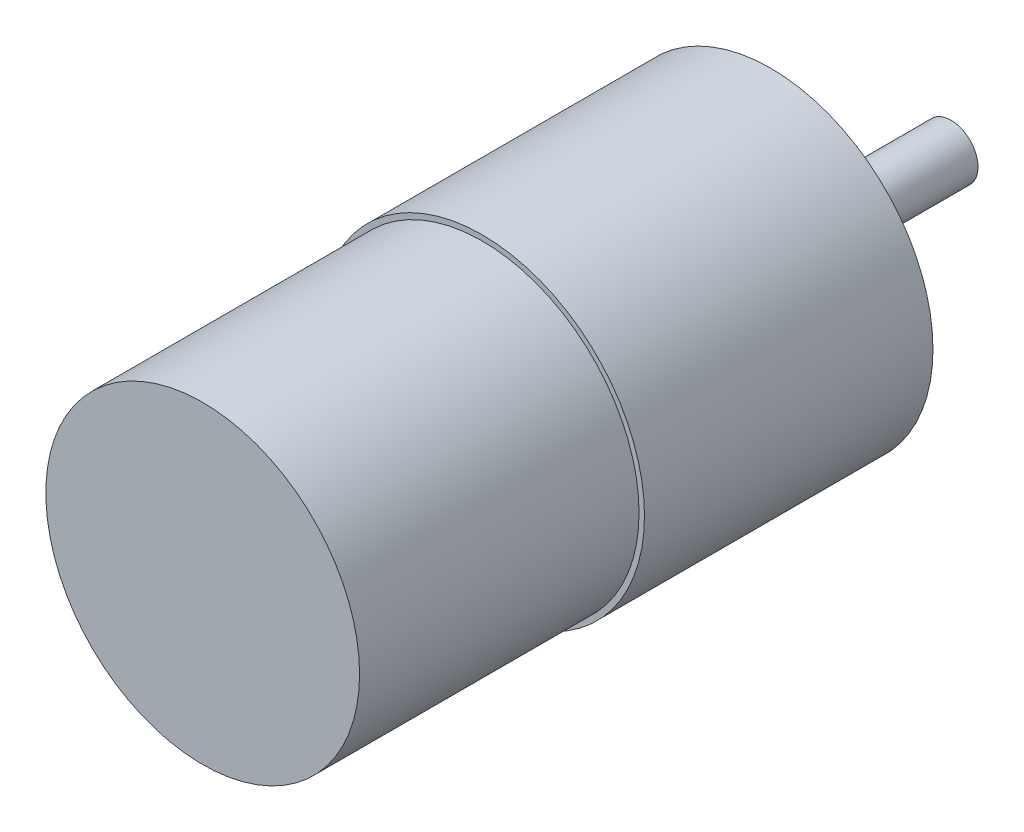
ISO-10303-21;
HEADER;
FILE_DESCRIPTION(('STEP AP214'),'2;1');
FILE_NAME('part.step','',(''),(''),'','','');
FILE_SCHEMA(('AUTOMOTIVE_DESIGN { 1 0 10303 214 1 1 1 1 }'));
ENDSEC;
DATA;
#1=APPLICATION_CONTEXT('core data for automotive mechanical design processes');
#2=APPLICATION_PROTOCOL_DEFINITION('international standard','automotive_design',2000,#1);
#3=PRODUCT_CONTEXT('',#1,'mechanical');
#4=PRODUCT('Part','Part','',(#3));
#5=PRODUCT_RELATED_PRODUCT_CATEGORY('part','',(#4));
#6=PRODUCT_DEFINITION_FORMATION('','',#4);
#7=PRODUCT_DEFINITION_CONTEXT('part definition',#1,'design');
#8=PRODUCT_DEFINITION('design','',#6,#7);
#9=PRODUCT_DEFINITION_SHAPE('','',#8);
#10=(LENGTH_UNIT() NAMED_UNIT(*) SI_UNIT(.MILLI.,.METRE.));
#11=(NAMED_UNIT(*) PLANE_ANGLE_UNIT() SI_UNIT($,.RADIAN.));
#12=(NAMED_UNIT(*) SI_UNIT($,.STERADIAN.) SOLID_ANGLE_UNIT());
#13=UNCERTAINTY_MEASURE_WITH_UNIT(LENGTH_MEASURE(1.E-05),#10,'distance_accuracy_value','');
#14=(GEOMETRIC_REPRESENTATION_CONTEXT(3) GLOBAL_UNCERTAINTY_ASSIGNED_CONTEXT((#13)) GLOBAL_UNIT_ASSIGNED_CONTEXT((#10,
#11,#12)) REPRESENTATION_CONTEXT('',''));
#15=CARTESIAN_POINT('',(0.,0.,0.));
#16=DIRECTION('',(0.,0.,1.));
#17=DIRECTION('',(1.,0.,0.));
#18=AXIS2_PLACEMENT_3D('',#15,#16,#17);
#19=CARTESIAN_POINT('',(0.,0.,32.));
#20=DIRECTION('',(0.,0.,-1.));
#21=DIRECTION('',(-1.,0.,0.));
#22=AXIS2_PLACEMENT_3D('',#19,#20,#21);
#23=CYLINDRICAL_SURFACE('',#22,18.);
#24=CARTESIAN_POINT('',(0.,0.,32.));
#25=DIRECTION('',(0.,0.,1.));
#26=DIRECTION('',(1.,0.,0.));
#27=AXIS2_PLACEMENT_3D('',#24,#25,#26);
#28=CIRCLE('',#27,18.);
#29=CARTESIAN_POINT('',(18.,0.,32.));
#30=VERTEX_POINT('',#29);
#31=EDGE_CURVE('E66',#30,#30,#28,.T.);
#32=ORIENTED_EDGE('',*,*,#31,.F.);
#33=EDGE_LOOP('',(#32));
#34=FACE_BOUND('',#33,.T.);
#35=CARTESIAN_POINT('',(0.,0.,0.));
#36=DIRECTION('',(0.,0.,1.));
#37=DIRECTION('',(1.,0.,0.));
#38=AXIS2_PLACEMENT_3D('',#35,#36,#37);
#39=CIRCLE('',#38,18.);
#40=CARTESIAN_POINT('',(18.,0.,0.));
#41=VERTEX_POINT('',#40);
#42=EDGE_CURVE('E38',#41,#41,#39,.T.);
#43=ORIENTED_EDGE('',*,*,#42,.T.);
#44=EDGE_LOOP('',(#43));
#45=FACE_BOUND('',#44,.T.);
#46=ADVANCED_FACE('F35',(#34,#45),#23,.T.);
#47=CARTESIAN_POINT('',(0.,0.,32.));
#48=DIRECTION('',(0.,0.,1.));
#49=DIRECTION('',(1.,0.,0.));
#50=AXIS2_PLACEMENT_3D('',#47,#48,#49);
#51=PLANE('',#50);
#52=CARTESIAN_POINT('',(0.,0.,32.));
#53=DIRECTION('',(0.,0.,1.));
#54=DIRECTION('',(1.,0.,0.));
#55=AXIS2_PLACEMENT_3D('',#52,#53,#54);
#56=CIRCLE('',#55,17.4);
#57=CARTESIAN_POINT('',(17.4,0.,32.));
#58=VERTEX_POINT('',#57);
#59=EDGE_CURVE('E62',#58,#58,#56,.T.);
#60=ORIENTED_EDGE('',*,*,#59,.F.);
#61=EDGE_LOOP('',(#60));
#62=FACE_BOUND('',#61,.T.);
#63=ORIENTED_EDGE('',*,*,#31,.T.);
#64=EDGE_LOOP('',(#63));
#65=FACE_BOUND('',#64,.T.);
#66=ADVANCED_FACE('F77',(#62,#65),#51,.T.);
#67=CARTESIAN_POINT('',(0.,0.,0.));
#68=DIRECTION('',(0.,0.,1.));
#69=DIRECTION('',(1.,0.,0.));
#70=AXIS2_PLACEMENT_3D('',#67,#68,#69);
#71=PLANE('',#70);
#72=CARTESIAN_POINT('',(14.,0.,0.));
#73=DIRECTION('',(0.,0.,-1.));
#74=DIRECTION('',(-1.,0.,0.));
#75=AXIS2_PLACEMENT_3D('',#72,#73,#74);
#76=CIRCLE('',#75,1.5);
#77=CARTESIAN_POINT('',(12.5,0.,0.));
#78=VERTEX_POINT('',#77);
#79=EDGE_CURVE('E266',#78,#78,#76,.T.);
#80=ORIENTED_EDGE('',*,*,#79,.F.);
#81=EDGE_LOOP('',(#80));
#82=FACE_BOUND('',#81,.T.);
#83=CARTESIAN_POINT('',(0.,14.,0.));
#84=DIRECTION('',(0.,0.,-1.));
#85=DIRECTION('',(-1.,0.,0.));
#86=AXIS2_PLACEMENT_3D('',#83,#84,#85);
#87=CIRCLE('',#86,1.5);
#88=CARTESIAN_POINT('',(-1.5,14.,0.));
#89=VERTEX_POINT('',#88);
#90=EDGE_CURVE('E270',#89,#89,#87,.T.);
#91=ORIENTED_EDGE('',*,*,#90,.F.);
#92=EDGE_LOOP('',(#91));
#93=FACE_BOUND('',#92,.T.);
#94=CARTESIAN_POINT('',(-14.,0.,0.));
#95=DIRECTION('',(0.,0.,-1.));
#96=DIRECTION('',(-1.,0.,0.));
#97=AXIS2_PLACEMENT_3D('',#94,#95,#96);
#98=CIRCLE('',#97,1.5);
#99=CARTESIAN_POINT('',(-15.5,0.,0.));
#100=VERTEX_POINT('',#99);
#101=EDGE_CURVE('E278',#100,#100,#98,.T.);
#102=ORIENTED_EDGE('',*,*,#101,.F.);
#103=EDGE_LOOP('',(#102));
#104=FACE_BOUND('',#103,.T.);
#105=CARTESIAN_POINT('',(0.,-14.,0.));
#106=DIRECTION('',(0.,0.,-1.));
#107=DIRECTION('',(-1.,0.,0.));
#108=AXIS2_PLACEMENT_3D('',#105,#106,#107);
#109=CIRCLE('',#108,1.5);
#110=CARTESIAN_POINT('',(-1.5,-14.,0.));
#111=VERTEX_POINT('',#110);
#112=EDGE_CURVE('E284',#111,#111,#109,.T.);
#113=ORIENTED_EDGE('',*,*,#112,.F.);
#114=EDGE_LOOP('',(#113));
#115=FACE_BOUND('',#114,.T.);
#116=CARTESIAN_POINT('',(0.,0.,0.));
#117=DIRECTION('',(0.,0.,-1.));
#118=DIRECTION('',(-1.,0.,0.));
#119=AXIS2_PLACEMENT_3D('',#116,#117,#118);
#120=CIRCLE('',#119,11.);
#121=CARTESIAN_POINT('',(-11.,0.,0.));
#122=VERTEX_POINT('',#121);
#123=EDGE_CURVE('E47',#122,#122,#120,.T.);
#124=ORIENTED_EDGE('',*,*,#123,.F.);
#125=EDGE_LOOP('',(#124));
#126=FACE_BOUND('',#125,.T.);
#127=ORIENTED_EDGE('',*,*,#42,.F.);
#128=EDGE_LOOP('',(#127));
#129=FACE_BOUND('',#128,.T.);
#130=ADVANCED_FACE('F74',(#82,#93,#104,#115,#126,#129),#71,.F.);
#131=CARTESIAN_POINT('',(0.,0.,63.));
#132=DIRECTION('',(0.,0.,-1.));
#133=DIRECTION('',(-1.,0.,0.));
#134=AXIS2_PLACEMENT_3D('',#131,#132,#133);
#135=CYLINDRICAL_SURFACE('',#134,17.4);
#136=CARTESIAN_POINT('',(0.,0.,63.));
#137=DIRECTION('',(0.,0.,1.));
#138=DIRECTION('',(1.,0.,0.));
#139=AXIS2_PLACEMENT_3D('',#136,#137,#138);
#140=CIRCLE('',#139,17.4);
#141=CARTESIAN_POINT('',(17.4,0.,63.));
#142=VERTEX_POINT('',#141);
#143=EDGE_CURVE('E59',#142,#142,#140,.T.);
#144=ORIENTED_EDGE('',*,*,#143,.F.);
#145=EDGE_LOOP('',(#144));
#146=FACE_BOUND('',#145,.T.);
#147=ORIENTED_EDGE('',*,*,#59,.T.);
#148=EDGE_LOOP('',(#147));
#149=FACE_BOUND('',#148,.T.);
#150=ADVANCED_FACE('F76',(#146,#149),#135,.T.);
#151=CARTESIAN_POINT('',(0.,0.,63.));
#152=DIRECTION('',(0.,0.,1.));
#153=DIRECTION('',(1.,0.,0.));
#154=AXIS2_PLACEMENT_3D('',#151,#152,#153);
#155=PLANE('',#154);
#156=ORIENTED_EDGE('',*,*,#143,.T.);
#157=EDGE_LOOP('',(#156));
#158=FACE_BOUND('',#157,.T.);
#159=ADVANCED_FACE('F83',(#158),#155,.T.);
#160=CARTESIAN_POINT('',(0.,0.,-2.));
#161=DIRECTION('',(0.,0.,1.));
#162=DIRECTION('',(1.,0.,0.));
#163=AXIS2_PLACEMENT_3D('',#160,#161,#162);
#164=CYLINDRICAL_SURFACE('',#163,11.);
#165=CARTESIAN_POINT('',(0.,0.,-2.));
#166=DIRECTION('',(0.,0.,-1.));
#167=DIRECTION('',(-1.,0.,0.));
#168=AXIS2_PLACEMENT_3D('',#165,#166,#167);
#169=CIRCLE('',#168,11.);
#170=CARTESIAN_POINT('',(-11.,0.,-2.));
#171=VERTEX_POINT('',#170);
#172=EDGE_CURVE('E55',#171,#171,#169,.T.);
#173=ORIENTED_EDGE('',*,*,#172,.F.);
#174=EDGE_LOOP('',(#173));
#175=FACE_BOUND('',#174,.T.);
#176=ORIENTED_EDGE('',*,*,#123,.T.);
#177=EDGE_LOOP('',(#176));
#178=FACE_BOUND('',#177,.T.);
#179=ADVANCED_FACE('F116',(#175,#178),#164,.T.);
#180=CARTESIAN_POINT('',(0.,0.,-2.));
#181=DIRECTION('',(0.,0.,-1.));
#182=DIRECTION('',(-1.,0.,0.));
#183=AXIS2_PLACEMENT_3D('',#180,#181,#182);
#184=PLANE('',#183);
#185=CARTESIAN_POINT('',(0.,0.,-2.));
#186=DIRECTION('',(0.,0.,-1.));
#187=DIRECTION('',(-1.,0.,0.));
#188=AXIS2_PLACEMENT_3D('',#185,#186,#187);
#189=CIRCLE('',#188,4.);
#190=CARTESIAN_POINT('',(-4.,0.,-2.));
#191=VERTEX_POINT('',#190);
#192=EDGE_CURVE('E42',#191,#191,#189,.T.);
#193=ORIENTED_EDGE('',*,*,#192,.F.);
#194=EDGE_LOOP('',(#193));
#195=FACE_BOUND('',#194,.T.);
#196=ORIENTED_EDGE('',*,*,#172,.T.);
#197=EDGE_LOOP('',(#196));
#198=FACE_BOUND('',#197,.T.);
#199=ADVANCED_FACE('F126',(#195,#198),#184,.T.);
#200=CARTESIAN_POINT('',(0.,0.,-5.));
#201=DIRECTION('',(0.,0.,1.));
#202=DIRECTION('',(1.,0.,0.));
#203=AXIS2_PLACEMENT_3D('',#200,#201,#202);
#204=CYLINDRICAL_SURFACE('',#203,4.);
#205=CARTESIAN_POINT('',(0.,0.,-5.));
#206=DIRECTION('',(0.,0.,-1.));
#207=DIRECTION('',(-1.,0.,0.));
#208=AXIS2_PLACEMENT_3D('',#205,#206,#207);
#209=CIRCLE('',#208,4.);
#210=CARTESIAN_POINT('',(-4.,0.,-5.));
#211=VERTEX_POINT('',#210);
#212=EDGE_CURVE('E53',#211,#211,#209,.T.);
#213=ORIENTED_EDGE('',*,*,#212,.F.);
#214=EDGE_LOOP('',(#213));
#215=FACE_BOUND('',#214,.T.);
#216=ORIENTED_EDGE('',*,*,#192,.T.);
#217=EDGE_LOOP('',(#216));
#218=FACE_BOUND('',#217,.T.);
#219=ADVANCED_FACE('F136',(#215,#218),#204,.T.);
#220=CARTESIAN_POINT('',(0.,0.,-5.));
#221=DIRECTION('',(0.,0.,-1.));
#222=DIRECTION('',(-1.,0.,0.));
#223=AXIS2_PLACEMENT_3D('',#220,#221,#222);
#224=PLANE('',#223);
#225=CARTESIAN_POINT('',(0.,0.,-5.));
#226=DIRECTION('',(0.,0.,-1.));
#227=DIRECTION('',(-1.,0.,0.));
#228=AXIS2_PLACEMENT_3D('',#225,#226,#227);
#229=CIRCLE('',#228,3.);
#230=CARTESIAN_POINT('',(-3.,0.,-5.));
#231=VERTEX_POINT('',#230);
#232=EDGE_CURVE('E10',#231,#231,#229,.T.);
#233=ORIENTED_EDGE('',*,*,#232,.F.);
#234=EDGE_LOOP('',(#233));
#235=FACE_BOUND('',#234,.T.);
#236=ORIENTED_EDGE('',*,*,#212,.T.);
#237=EDGE_LOOP('',(#236));
#238=FACE_BOUND('',#237,.T.);
#239=ADVANCED_FACE('F146',(#235,#238),#224,.T.);
#240=CARTESIAN_POINT('',(0.,0.,-20.));
#241=DIRECTION('',(0.,0.,1.));
#242=DIRECTION('',(1.,0.,0.));
#243=AXIS2_PLACEMENT_3D('',#240,#241,#242);
#244=CYLINDRICAL_SURFACE('',#243,3.);
#245=CARTESIAN_POINT('',(0.,0.,-20.));
#246=DIRECTION('',(0.,0.,-1.));
#247=DIRECTION('',(-1.,0.,0.));
#248=AXIS2_PLACEMENT_3D('',#245,#246,#247);
#249=CIRCLE('',#248,3.);
#250=CARTESIAN_POINT('',(-3.,0.,-20.));
#251=VERTEX_POINT('',#250);
#252=EDGE_CURVE('E51',#251,#251,#249,.T.);
#253=ORIENTED_EDGE('',*,*,#252,.F.);
#254=EDGE_LOOP('',(#253));
#255=FACE_BOUND('',#254,.T.);
#256=ORIENTED_EDGE('',*,*,#232,.T.);
#257=EDGE_LOOP('',(#256));
#258=FACE_BOUND('',#257,.T.);
#259=ADVANCED_FACE('F156',(#255,#258),#244,.T.);
#260=CARTESIAN_POINT('',(0.,0.,-20.));
#261=DIRECTION('',(0.,0.,-1.));
#262=DIRECTION('',(-1.,0.,0.));
#263=AXIS2_PLACEMENT_3D('',#260,#261,#262);
#264=PLANE('',#263);
#265=ORIENTED_EDGE('',*,*,#252,.T.);
#266=EDGE_LOOP('',(#265));
#267=FACE_BOUND('',#266,.T.);
#268=ADVANCED_FACE('F166',(#267),#264,.T.);
#269=CARTESIAN_POINT('',(0.,-14.,5.));
#270=DIRECTION('',(0.,0.,-1.));
#271=DIRECTION('',(-1.,0.,0.));
#272=AXIS2_PLACEMENT_3D('',#269,#270,#271);
#273=CYLINDRICAL_SURFACE('',#272,1.5);
#274=CARTESIAN_POINT('',(0.,-14.,5.));
#275=DIRECTION('',(0.,0.,-1.));
#276=DIRECTION('',(-1.,0.,0.));
#277=AXIS2_PLACEMENT_3D('',#274,#275,#276);
#278=CIRCLE('',#277,1.5);
#279=CARTESIAN_POINT('',(-1.5,-14.,5.));
#280=VERTEX_POINT('',#279);
#281=EDGE_CURVE('E286',#280,#280,#278,.T.);
#282=ORIENTED_EDGE('',*,*,#281,.F.);
#283=EDGE_LOOP('',(#282));
#284=FACE_BOUND('',#283,.T.);
#285=ORIENTED_EDGE('',*,*,#112,.T.);
#286=EDGE_LOOP('',(#285));
#287=FACE_BOUND('',#286,.T.);
#288=ADVANCED_FACE('F175',(#284,#287),#273,.F.);
#289=CARTESIAN_POINT('',(0.,-14.,5.));
#290=DIRECTION('',(0.,0.,-1.));
#291=DIRECTION('',(-1.,0.,0.));
#292=AXIS2_PLACEMENT_3D('',#289,#290,#291);
#293=PLANE('',#292);
#294=ORIENTED_EDGE('',*,*,#281,.T.);
#295=EDGE_LOOP('',(#294));
#296=FACE_BOUND('',#295,.T.);
#297=ADVANCED_FACE('F189',(#296),#293,.T.);
#298=CARTESIAN_POINT('',(-14.,0.,5.));
#299=DIRECTION('',(0.,0.,-1.));
#300=DIRECTION('',(-1.,0.,0.));
#301=AXIS2_PLACEMENT_3D('',#298,#299,#300);
#302=CYLINDRICAL_SURFACE('',#301,1.5);
#303=CARTESIAN_POINT('',(-14.,0.,5.));
#304=DIRECTION('',(0.,0.,-1.));
#305=DIRECTION('',(-1.,0.,0.));
#306=AXIS2_PLACEMENT_3D('',#303,#304,#305);
#307=CIRCLE('',#306,1.5);
#308=CARTESIAN_POINT('',(-15.5,0.,5.));
#309=VERTEX_POINT('',#308);
#310=EDGE_CURVE('E281',#309,#309,#307,.T.);
#311=ORIENTED_EDGE('',*,*,#310,.F.);
#312=EDGE_LOOP('',(#311));
#313=FACE_BOUND('',#312,.T.);
#314=ORIENTED_EDGE('',*,*,#101,.T.);
#315=EDGE_LOOP('',(#314));
#316=FACE_BOUND('',#315,.T.);
#317=ADVANCED_FACE('F199',(#313,#316),#302,.F.);
#318=CARTESIAN_POINT('',(-14.,0.,5.));
#319=DIRECTION('',(0.,0.,-1.));
#320=DIRECTION('',(-1.,0.,0.));
#321=AXIS2_PLACEMENT_3D('',#318,#319,#320);
#322=PLANE('',#321);
#323=ORIENTED_EDGE('',*,*,#310,.T.);
#324=EDGE_LOOP('',(#323));
#325=FACE_BOUND('',#324,.T.);
#326=ADVANCED_FACE('F209',(#325),#322,.T.);
#327=CARTESIAN_POINT('',(0.,14.,5.));
#328=DIRECTION('',(0.,0.,-1.));
#329=DIRECTION('',(-1.,0.,0.));
#330=AXIS2_PLACEMENT_3D('',#327,#328,#329);
#331=CYLINDRICAL_SURFACE('',#330,1.5);
#332=CARTESIAN_POINT('',(0.,14.,5.));
#333=DIRECTION('',(0.,0.,-1.));
#334=DIRECTION('',(-1.,0.,0.));
#335=AXIS2_PLACEMENT_3D('',#332,#333,#334);
#336=CIRCLE('',#335,1.5);
#337=CARTESIAN_POINT('',(-1.5,14.,5.));
#338=VERTEX_POINT('',#337);
#339=EDGE_CURVE('E275',#338,#338,#336,.T.);
#340=ORIENTED_EDGE('',*,*,#339,.F.);
#341=EDGE_LOOP('',(#340));
#342=FACE_BOUND('',#341,.T.);
#343=ORIENTED_EDGE('',*,*,#90,.T.);
#344=EDGE_LOOP('',(#343));
#345=FACE_BOUND('',#344,.T.);
#346=ADVANCED_FACE('F219',(#342,#345),#331,.F.);
#347=CARTESIAN_POINT('',(0.,14.,5.));
#348=DIRECTION('',(0.,0.,-1.));
#349=DIRECTION('',(-1.,0.,0.));
#350=AXIS2_PLACEMENT_3D('',#347,#348,#349);
#351=PLANE('',#350);
#352=ORIENTED_EDGE('',*,*,#339,.T.);
#353=EDGE_LOOP('',(#352));
#354=FACE_BOUND('',#353,.T.);
#355=ADVANCED_FACE('F229',(#354),#351,.T.);
#356=CARTESIAN_POINT('',(14.,0.,5.));
#357=DIRECTION('',(0.,0.,-1.));
#358=DIRECTION('',(-1.,0.,0.));
#359=AXIS2_PLACEMENT_3D('',#356,#357,#358);
#360=CYLINDRICAL_SURFACE('',#359,1.5);
#361=CARTESIAN_POINT('',(14.,0.,5.));
#362=DIRECTION('',(0.,0.,-1.));
#363=DIRECTION('',(-1.,0.,0.));
#364=AXIS2_PLACEMENT_3D('',#361,#362,#363);
#365=CIRCLE('',#364,1.5);
#366=CARTESIAN_POINT('',(12.5,0.,5.));
#367=VERTEX_POINT('',#366);
#368=EDGE_CURVE('E265',#367,#367,#365,.T.);
#369=ORIENTED_EDGE('',*,*,#368,.F.);
#370=EDGE_LOOP('',(#369));
#371=FACE_BOUND('',#370,.T.);
#372=ORIENTED_EDGE('',*,*,#79,.T.);
#373=EDGE_LOOP('',(#372));
#374=FACE_BOUND('',#373,.T.);
#375=ADVANCED_FACE('F239',(#371,#374),#360,.F.);
#376=CARTESIAN_POINT('',(14.,0.,5.));
#377=DIRECTION('',(0.,0.,-1.));
#378=DIRECTION('',(-1.,0.,0.));
#379=AXIS2_PLACEMENT_3D('',#376,#377,#378);
#380=PLANE('',#379);
#381=ORIENTED_EDGE('',*,*,#368,.T.);
#382=EDGE_LOOP('',(#381));
#383=FACE_BOUND('',#382,.T.);
#384=ADVANCED_FACE('F249',(#383),#380,.T.);
#385=CLOSED_SHELL('',(#46,#66,#130,#150,#159,#179,#199,#219,#239,#259,#268,#288,#297,#317,#326,
#346,#355,#375,#384));
#386=MANIFOLD_SOLID_BREP('B2',#385);
#387=ADVANCED_BREP_SHAPE_REPRESENTATION('',(#18,#386),#14);
#388=SHAPE_DEFINITION_REPRESENTATION(#9,#387);
ENDSEC;
END-ISO-10303-21;
